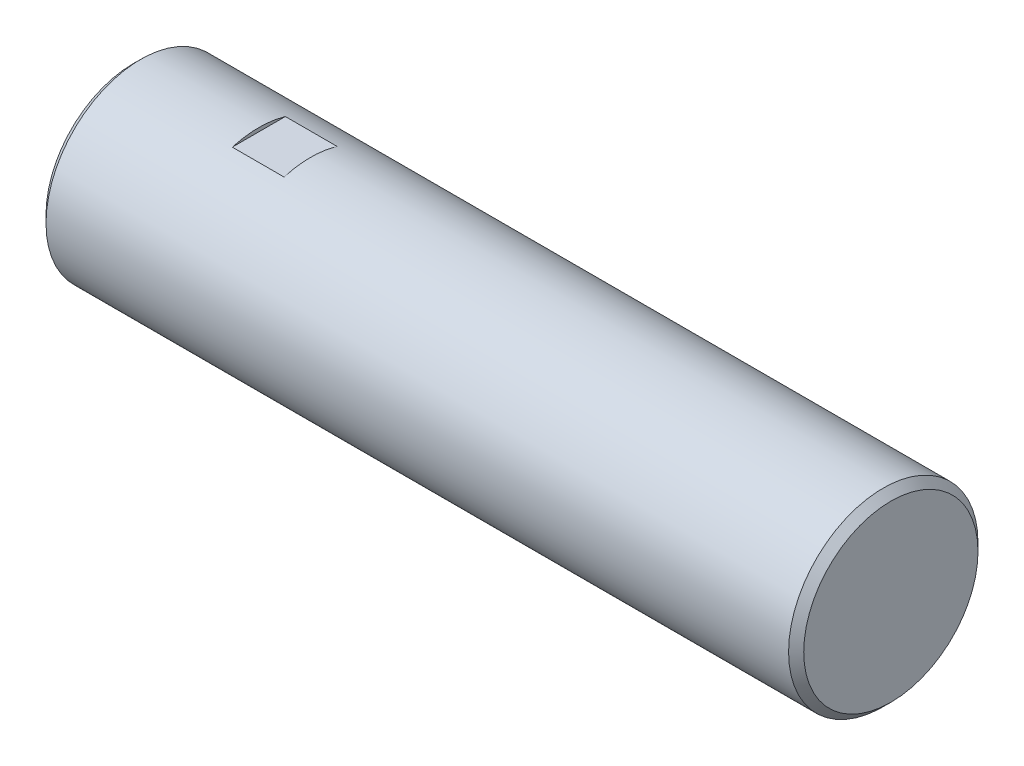
ISO-10303-21;
HEADER;
FILE_DESCRIPTION(('STEP AP214'),'2;1');
FILE_NAME('part.step','',(''),(''),'','','');
FILE_SCHEMA(('AUTOMOTIVE_DESIGN { 1 0 10303 214 1 1 1 1 }'));
ENDSEC;
DATA;
#1=APPLICATION_CONTEXT('core data for automotive mechanical design processes');
#2=APPLICATION_PROTOCOL_DEFINITION('international standard','automotive_design',2000,#1);
#3=PRODUCT_CONTEXT('',#1,'mechanical');
#4=PRODUCT('Part','Part','',(#3));
#5=PRODUCT_RELATED_PRODUCT_CATEGORY('part','',(#4));
#6=PRODUCT_DEFINITION_FORMATION('','',#4);
#7=PRODUCT_DEFINITION_CONTEXT('part definition',#1,'design');
#8=PRODUCT_DEFINITION('design','',#6,#7);
#9=PRODUCT_DEFINITION_SHAPE('','',#8);
#10=(LENGTH_UNIT() NAMED_UNIT(*) SI_UNIT(.MILLI.,.METRE.));
#11=(NAMED_UNIT(*) PLANE_ANGLE_UNIT() SI_UNIT($,.RADIAN.));
#12=(NAMED_UNIT(*) SI_UNIT($,.STERADIAN.) SOLID_ANGLE_UNIT());
#13=UNCERTAINTY_MEASURE_WITH_UNIT(LENGTH_MEASURE(1.E-05),#10,'distance_accuracy_value','');
#14=(GEOMETRIC_REPRESENTATION_CONTEXT(3) GLOBAL_UNCERTAINTY_ASSIGNED_CONTEXT((#13)) GLOBAL_UNIT_ASSIGNED_CONTEXT((#10,
#11,#12)) REPRESENTATION_CONTEXT('',''));
#15=CARTESIAN_POINT('',(0.,0.,0.));
#16=DIRECTION('',(0.,0.,1.));
#17=DIRECTION('',(1.,0.,0.));
#18=AXIS2_PLACEMENT_3D('',#15,#16,#17);
#19=CARTESIAN_POINT('',(25.4,0.,0.));
#20=DIRECTION('',(-1.,0.,0.));
#21=DIRECTION('',(0.,0.,1.));
#22=AXIS2_PLACEMENT_3D('',#19,#20,#21);
#23=CYLINDRICAL_SURFACE('',#22,3.175);
#24=DIRECTION('',(-1.,0.,0.));
#25=VECTOR('',#24,1.);
#26=CARTESIAN_POINT('',(25.4,3.048,-0.889));
#27=LINE('',#26,#25);
#28=CARTESIAN_POINT('',(4.21314312613378,3.048,-0.889));
#29=VERTEX_POINT('',#28);
#30=CARTESIAN_POINT('',(5.94685687386622,3.048,-0.889));
#31=VERTEX_POINT('',#30);
#32=EDGE_CURVE('E64',#29,#31,#27,.F.);
#33=ORIENTED_EDGE('',*,*,#32,.T.);
#34=CARTESIAN_POINT('',(5.94685687386622,0.,0.));
#35=DIRECTION('',(1.,0.,0.));
#36=DIRECTION('',(0.,0.,-1.));
#37=AXIS2_PLACEMENT_3D('',#34,#35,#36);
#38=CIRCLE('',#37,3.175);
#39=CARTESIAN_POINT('',(5.94685687386622,3.048,0.889));
#40=VERTEX_POINT('',#39);
#41=EDGE_CURVE('E11',#31,#40,#38,.T.);
#42=ORIENTED_EDGE('',*,*,#41,.T.);
#43=DIRECTION('',(-1.,0.,0.));
#44=VECTOR('',#43,1.);
#45=CARTESIAN_POINT('',(25.4,3.048,0.889));
#46=LINE('',#45,#44);
#47=CARTESIAN_POINT('',(4.21314312613378,3.048,0.889));
#48=VERTEX_POINT('',#47);
#49=EDGE_CURVE('E41',#40,#48,#46,.T.);
#50=ORIENTED_EDGE('',*,*,#49,.T.);
#51=CARTESIAN_POINT('',(4.21314312613378,0.,0.));
#52=DIRECTION('',(-1.,0.,0.));
#53=DIRECTION('',(0.,-1.,0.));
#54=AXIS2_PLACEMENT_3D('',#51,#52,#53);
#55=CIRCLE('',#54,3.175);
#56=EDGE_CURVE('E60',#48,#29,#55,.T.);
#57=ORIENTED_EDGE('',*,*,#56,.T.);
#58=EDGE_LOOP('',(#33,#42,#50,#57));
#59=FACE_BOUND('',#58,.T.);
#60=CARTESIAN_POINT('',(25.146,0.,0.));
#61=DIRECTION('',(1.,0.,0.));
#62=DIRECTION('',(0.,0.,-1.));
#63=AXIS2_PLACEMENT_3D('',#60,#61,#62);
#64=CIRCLE('',#63,3.175);
#65=CARTESIAN_POINT('',(25.146,0.,-3.175));
#66=VERTEX_POINT('',#65);
#67=EDGE_CURVE('E75',#66,#66,#64,.F.);
#68=ORIENTED_EDGE('',*,*,#67,.T.);
#69=EDGE_LOOP('',(#68));
#70=FACE_BOUND('',#69,.T.);
#71=CARTESIAN_POINT('',(0.253999999999997,0.,0.));
#72=DIRECTION('',(1.,0.,0.));
#73=DIRECTION('',(0.,0.,-1.));
#74=AXIS2_PLACEMENT_3D('',#71,#72,#73);
#75=CIRCLE('',#74,3.175);
#76=CARTESIAN_POINT('',(0.253999999999997,0.,-3.175));
#77=VERTEX_POINT('',#76);
#78=EDGE_CURVE('E78',#77,#77,#75,.T.);
#79=ORIENTED_EDGE('',*,*,#78,.T.);
#80=EDGE_LOOP('',(#79));
#81=FACE_BOUND('',#80,.T.);
#82=ADVANCED_FACE('F33',(#59,#70,#81),#23,.T.);
#83=CARTESIAN_POINT('',(25.4,0.,0.));
#84=DIRECTION('',(1.,0.,0.));
#85=DIRECTION('',(0.,0.,-1.));
#86=AXIS2_PLACEMENT_3D('',#83,#84,#85);
#87=PLANE('',#86);
#88=CARTESIAN_POINT('',(25.4,0.,0.));
#89=DIRECTION('',(1.,0.,0.));
#90=DIRECTION('',(0.,0.,-1.));
#91=AXIS2_PLACEMENT_3D('',#88,#89,#90);
#92=CIRCLE('',#91,2.921);
#93=CARTESIAN_POINT('',(25.4,0.,-2.921));
#94=VERTEX_POINT('',#93);
#95=EDGE_CURVE('E81',#94,#94,#92,.T.);
#96=ORIENTED_EDGE('',*,*,#95,.T.);
#97=EDGE_LOOP('',(#96));
#98=FACE_BOUND('',#97,.T.);
#99=ADVANCED_FACE('F98',(#98),#87,.T.);
#100=CARTESIAN_POINT('',(0.,0.,0.));
#101=DIRECTION('',(1.,0.,0.));
#102=DIRECTION('',(0.,0.,-1.));
#103=AXIS2_PLACEMENT_3D('',#100,#101,#102);
#104=PLANE('',#103);
#105=CARTESIAN_POINT('',(0.,0.,0.));
#106=DIRECTION('',(1.,0.,0.));
#107=DIRECTION('',(0.,0.,-1.));
#108=AXIS2_PLACEMENT_3D('',#105,#106,#107);
#109=CIRCLE('',#108,2.921);
#110=CARTESIAN_POINT('',(0.,0.,-2.921));
#111=VERTEX_POINT('',#110);
#112=EDGE_CURVE('E65',#111,#111,#109,.F.);
#113=ORIENTED_EDGE('',*,*,#112,.T.);
#114=EDGE_LOOP('',(#113));
#115=FACE_BOUND('',#114,.T.);
#116=ADVANCED_FACE('F103',(#115),#104,.F.);
#117=CARTESIAN_POINT('',(25.4,0.,0.));
#118=DIRECTION('',(-1.,0.,0.));
#119=DIRECTION('',(0.,0.,1.));
#120=AXIS2_PLACEMENT_3D('',#117,#118,#119);
#121=CONICAL_SURFACE('',#120,2.921,0.785398163397447);
#122=ORIENTED_EDGE('',*,*,#67,.F.);
#123=EDGE_LOOP('',(#122));
#124=FACE_BOUND('',#123,.T.);
#125=ORIENTED_EDGE('',*,*,#95,.F.);
#126=EDGE_LOOP('',(#125));
#127=FACE_BOUND('',#126,.T.);
#128=ADVANCED_FACE('F93',(#124,#127),#121,.T.);
#129=CARTESIAN_POINT('',(0.253999999999997,0.,0.));
#130=DIRECTION('',(1.,0.,0.));
#131=DIRECTION('',(0.,0.,-1.));
#132=AXIS2_PLACEMENT_3D('',#129,#130,#131);
#133=CONICAL_SURFACE('',#132,3.175,0.785398163397446);
#134=ORIENTED_EDGE('',*,*,#112,.F.);
#135=EDGE_LOOP('',(#134));
#136=FACE_BOUND('',#135,.T.);
#137=ORIENTED_EDGE('',*,*,#78,.F.);
#138=EDGE_LOOP('',(#137));
#139=FACE_BOUND('',#138,.T.);
#140=ADVANCED_FACE('F35',(#136,#139),#133,.T.);
#141=CARTESIAN_POINT('',(5.94685687386622,6.30399898964385,-3.175));
#142=DIRECTION('',(1.,0.,0.));
#143=DIRECTION('',(0.,0.,-1.));
#144=AXIS2_PLACEMENT_3D('',#141,#142,#143);
#145=PLANE('',#144);
#146=DIRECTION('',(0.,0.,1.));
#147=VECTOR('',#146,1.);
#148=CARTESIAN_POINT('',(5.94685687386622,3.048,-3.175));
#149=LINE('',#148,#147);
#150=EDGE_CURVE('E68',#31,#40,#149,.T.);
#151=ORIENTED_EDGE('',*,*,#150,.T.);
#152=ORIENTED_EDGE('',*,*,#41,.F.);
#153=EDGE_LOOP('',(#151,#152));
#154=FACE_BOUND('',#153,.T.);
#155=ADVANCED_FACE('F85',(#154),#145,.F.);
#156=CARTESIAN_POINT('',(4.21314312613378,3.048,-3.175));
#157=DIRECTION('',(0.,-1.,0.));
#158=DIRECTION('',(0.,0.,-1.));
#159=AXIS2_PLACEMENT_3D('',#156,#157,#158);
#160=PLANE('',#159);
#161=ORIENTED_EDGE('',*,*,#150,.F.);
#162=ORIENTED_EDGE('',*,*,#32,.F.);
#163=DIRECTION('',(0.,0.,1.));
#164=VECTOR('',#163,1.);
#165=CARTESIAN_POINT('',(4.21314312613378,3.048,-3.175));
#166=LINE('',#165,#164);
#167=EDGE_CURVE('E47',#29,#48,#166,.T.);
#168=ORIENTED_EDGE('',*,*,#167,.T.);
#169=ORIENTED_EDGE('',*,*,#49,.F.);
#170=EDGE_LOOP('',(#161,#162,#168,#169));
#171=FACE_BOUND('',#170,.T.);
#172=ADVANCED_FACE('F67',(#171),#160,.F.);
#173=CARTESIAN_POINT('',(4.21314312613378,6.30399898964385,-3.175));
#174=DIRECTION('',(-1.,0.,0.));
#175=DIRECTION('',(0.,-1.,0.));
#176=AXIS2_PLACEMENT_3D('',#173,#174,#175);
#177=PLANE('',#176);
#178=ORIENTED_EDGE('',*,*,#167,.F.);
#179=ORIENTED_EDGE('',*,*,#56,.F.);
#180=EDGE_LOOP('',(#178,#179));
#181=FACE_BOUND('',#180,.T.);
#182=ADVANCED_FACE('F61',(#181),#177,.F.);
#183=CLOSED_SHELL('',(#82,#99,#116,#128,#140,#155,#172,#182));
#184=MANIFOLD_SOLID_BREP('B2',#183);
#185=ADVANCED_BREP_SHAPE_REPRESENTATION('',(#18,#184),#14);
#186=SHAPE_DEFINITION_REPRESENTATION(#9,#185);
ENDSEC;
END-ISO-10303-21;
